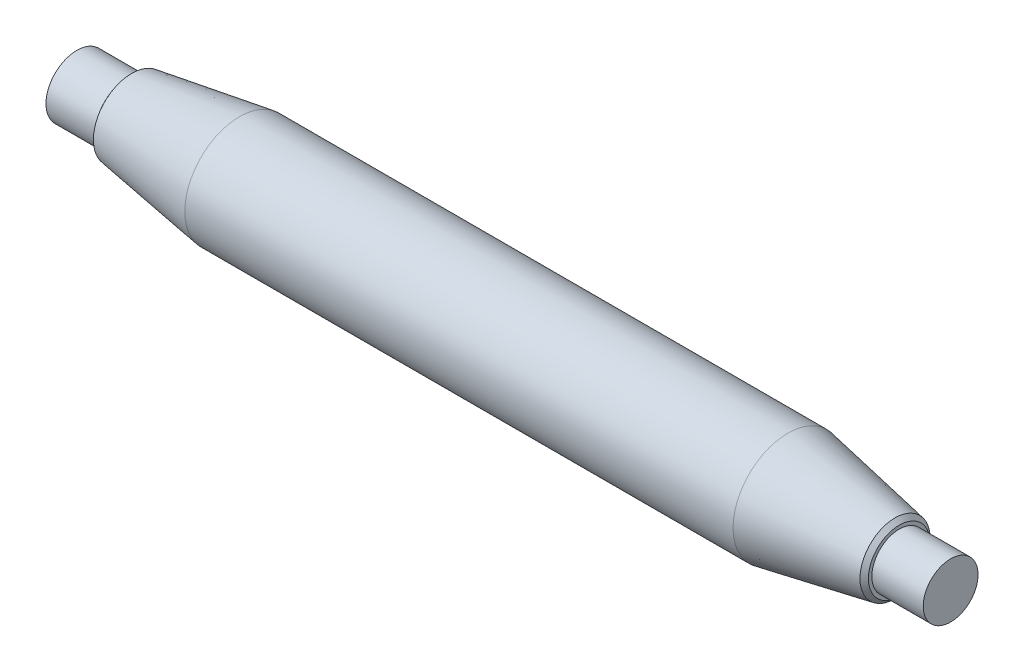
ISO-10303-21;
HEADER;
FILE_DESCRIPTION(('STEP AP214'),'2;1');
FILE_NAME('part.step','',(''),(''),'','','');
FILE_SCHEMA(('AUTOMOTIVE_DESIGN { 1 0 10303 214 1 1 1 1 }'));
ENDSEC;
DATA;
#1=APPLICATION_CONTEXT('core data for automotive mechanical design processes');
#2=APPLICATION_PROTOCOL_DEFINITION('international standard','automotive_design',2000,#1);
#3=PRODUCT_CONTEXT('',#1,'mechanical');
#4=PRODUCT('Part','Part','',(#3));
#5=PRODUCT_RELATED_PRODUCT_CATEGORY('part','',(#4));
#6=PRODUCT_DEFINITION_FORMATION('','',#4);
#7=PRODUCT_DEFINITION_CONTEXT('part definition',#1,'design');
#8=PRODUCT_DEFINITION('design','',#6,#7);
#9=PRODUCT_DEFINITION_SHAPE('','',#8);
#10=(LENGTH_UNIT() NAMED_UNIT(*) SI_UNIT(.MILLI.,.METRE.));
#11=(NAMED_UNIT(*) PLANE_ANGLE_UNIT() SI_UNIT($,.RADIAN.));
#12=(NAMED_UNIT(*) SI_UNIT($,.STERADIAN.) SOLID_ANGLE_UNIT());
#13=UNCERTAINTY_MEASURE_WITH_UNIT(LENGTH_MEASURE(1.E-05),#10,'distance_accuracy_value','');
#14=(GEOMETRIC_REPRESENTATION_CONTEXT(3) GLOBAL_UNCERTAINTY_ASSIGNED_CONTEXT((#13)) GLOBAL_UNIT_ASSIGNED_CONTEXT((#10,
#11,#12)) REPRESENTATION_CONTEXT('',''));
#15=CARTESIAN_POINT('',(0.,0.,0.));
#16=DIRECTION('',(0.,0.,1.));
#17=DIRECTION('',(1.,0.,0.));
#18=AXIS2_PLACEMENT_3D('',#15,#16,#17);
#19=CARTESIAN_POINT('',(127.5,0.,0.));
#20=DIRECTION('',(-1.,0.,0.));
#21=DIRECTION('',(0.,0.,1.));
#22=AXIS2_PLACEMENT_3D('',#19,#20,#21);
#23=PLANE('',#22);
#24=CARTESIAN_POINT('',(127.5,0.,0.));
#25=DIRECTION('',(-1.,0.,0.));
#26=DIRECTION('',(0.,0.,1.));
#27=AXIS2_PLACEMENT_3D('',#24,#25,#26);
#28=CIRCLE('',#27,7.99999999999999);
#29=CARTESIAN_POINT('',(127.5,0.,7.99999999999999));
#30=VERTEX_POINT('',#29);
#31=EDGE_CURVE('E74',#30,#30,#28,.T.);
#32=ORIENTED_EDGE('',*,*,#31,.F.);
#33=EDGE_LOOP('',(#32));
#34=FACE_BOUND('',#33,.T.);
#35=ADVANCED_FACE('F33',(#34),#23,.F.);
#36=CARTESIAN_POINT('',(-127.5,0.,0.));
#37=DIRECTION('',(-1.,0.,0.));
#38=DIRECTION('',(0.,0.,1.));
#39=AXIS2_PLACEMENT_3D('',#36,#37,#38);
#40=CYLINDRICAL_SURFACE('',#39,7.99999999999999);
#41=CARTESIAN_POINT('',(112.5,0.,0.));
#42=DIRECTION('',(-1.,0.,0.));
#43=DIRECTION('',(0.,0.,1.));
#44=AXIS2_PLACEMENT_3D('',#41,#42,#43);
#45=CIRCLE('',#44,7.99999999999999);
#46=CARTESIAN_POINT('',(112.5,0.,7.99999999999999));
#47=VERTEX_POINT('',#46);
#48=EDGE_CURVE('E71',#47,#47,#45,.T.);
#49=ORIENTED_EDGE('',*,*,#48,.F.);
#50=EDGE_LOOP('',(#49));
#51=FACE_BOUND('',#50,.T.);
#52=ORIENTED_EDGE('',*,*,#31,.T.);
#53=EDGE_LOOP('',(#52));
#54=FACE_BOUND('',#53,.T.);
#55=ADVANCED_FACE('F113',(#51,#54),#40,.T.);
#56=CARTESIAN_POINT('',(112.5,7.99999999999999,0.));
#57=DIRECTION('',(-1.,0.,0.));
#58=DIRECTION('',(0.,0.,1.));
#59=AXIS2_PLACEMENT_3D('',#56,#57,#58);
#60=PLANE('',#59);
#61=CARTESIAN_POINT('',(112.5,0.,0.));
#62=DIRECTION('',(-1.,0.,0.));
#63=DIRECTION('',(0.,0.,1.));
#64=AXIS2_PLACEMENT_3D('',#61,#62,#63);
#65=CIRCLE('',#64,8.99999999999998);
#66=CARTESIAN_POINT('',(112.5,0.,8.99999999999998));
#67=VERTEX_POINT('',#66);
#68=EDGE_CURVE('E55',#67,#67,#65,.F.);
#69=ORIENTED_EDGE('',*,*,#68,.T.);
#70=EDGE_LOOP('',(#69));
#71=FACE_BOUND('',#70,.T.);
#72=ORIENTED_EDGE('',*,*,#48,.T.);
#73=EDGE_LOOP('',(#72));
#74=FACE_BOUND('',#73,.T.);
#75=ADVANCED_FACE('F89',(#71,#74),#60,.F.);
#76=CARTESIAN_POINT('',(112.5,0.,0.));
#77=DIRECTION('',(-1.,0.,0.));
#78=DIRECTION('',(0.,0.,1.));
#79=AXIS2_PLACEMENT_3D('',#76,#77,#78);
#80=CONICAL_SURFACE('',#79,10.,0.182559853130907);
#81=CARTESIAN_POINT('',(111.27358490566,0.,0.));
#82=DIRECTION('',(1.,0.,0.));
#83=DIRECTION('',(0.,0.,-1.));
#84=AXIS2_PLACEMENT_3D('',#81,#82,#83);
#85=CIRCLE('',#84,10.2264150943396);
#86=CARTESIAN_POINT('',(111.27358490566,0.,-10.2264150943396));
#87=VERTEX_POINT('',#86);
#88=EDGE_CURVE('E83',#87,#87,#85,.F.);
#89=ORIENTED_EDGE('',*,*,#88,.T.);
#90=EDGE_LOOP('',(#89));
#91=FACE_BOUND('',#90,.T.);
#92=CARTESIAN_POINT('',(80.,0.,0.));
#93=DIRECTION('',(-1.,0.,0.));
#94=DIRECTION('',(0.,0.,1.));
#95=AXIS2_PLACEMENT_3D('',#92,#93,#94);
#96=CIRCLE('',#95,16.);
#97=CARTESIAN_POINT('',(80.,0.,16.));
#98=VERTEX_POINT('',#97);
#99=EDGE_CURVE('E68',#98,#98,#96,.T.);
#100=ORIENTED_EDGE('',*,*,#99,.F.);
#101=EDGE_LOOP('',(#100));
#102=FACE_BOUND('',#101,.T.);
#103=ADVANCED_FACE('F97',(#91,#102),#80,.T.);
#104=CARTESIAN_POINT('',(-127.5,0.,0.));
#105=DIRECTION('',(-1.,0.,0.));
#106=DIRECTION('',(0.,0.,1.));
#107=AXIS2_PLACEMENT_3D('',#104,#105,#106);
#108=CYLINDRICAL_SURFACE('',#107,16.);
#109=CARTESIAN_POINT('',(-22.7513466447618,0.,0.));
#110=DIRECTION('',(-0.990268068741571,0.,0.139173100960059));
#111=DIRECTION('',(-0.139173100960059,0.,-0.990268068741571));
#112=AXIS2_PLACEMENT_3D('',#109,#110,#111);
#113=ELLIPSE('',#112,16.1572411602979,16.);
#114=CARTESIAN_POINT('',(-24.3220796789207,11.4494228667417,-11.1763462732027));
#115=VERTEX_POINT('',#114);
#116=CARTESIAN_POINT('',(-24.3220796789207,-11.4494228667417,-11.1763462732027));
#117=VERTEX_POINT('',#116);
#118=EDGE_CURVE('E41',#115,#117,#113,.T.);
#119=ORIENTED_EDGE('',*,*,#118,.T.);
#120=CARTESIAN_POINT('',(-103.845915558153,0.,0.));
#121=DIRECTION('',(0.139173100960059,0.,0.990268068741571));
#122=DIRECTION('',(-0.990268068741571,0.,0.139173100960059));
#123=AXIS2_PLACEMENT_3D('',#120,#121,#122);
#124=ELLIPSE('',#123,114.964744549249,16.);
#125=EDGE_CURVE('E11',#117,#115,#124,.T.);
#126=ORIENTED_EDGE('',*,*,#125,.T.);
#127=EDGE_LOOP('',(#119,#126));
#128=FACE_BOUND('',#127,.T.);
#129=CARTESIAN_POINT('',(-80.,0.,0.));
#130=DIRECTION('',(-1.,0.,0.));
#131=DIRECTION('',(0.,0.,1.));
#132=AXIS2_PLACEMENT_3D('',#129,#130,#131);
#133=CIRCLE('',#132,16.);
#134=CARTESIAN_POINT('',(-80.,0.,16.));
#135=VERTEX_POINT('',#134);
#136=EDGE_CURVE('E65',#135,#135,#133,.T.);
#137=ORIENTED_EDGE('',*,*,#136,.F.);
#138=EDGE_LOOP('',(#137));
#139=FACE_BOUND('',#138,.T.);
#140=ORIENTED_EDGE('',*,*,#99,.T.);
#141=EDGE_LOOP('',(#140));
#142=FACE_BOUND('',#141,.T.);
#143=ADVANCED_FACE('F53',(#128,#139,#142),#108,.T.);
#144=CARTESIAN_POINT('',(-80.,0.,0.));
#145=DIRECTION('',(1.,0.,0.));
#146=DIRECTION('',(0.,0.,-1.));
#147=AXIS2_PLACEMENT_3D('',#144,#145,#146);
#148=CONICAL_SURFACE('',#147,16.,0.152649328395265);
#149=CARTESIAN_POINT('',(-111.511628302349,0.,0.));
#150=DIRECTION('',(-1.,0.,0.));
#151=DIRECTION('',(0.,0.,1.));
#152=AXIS2_PLACEMENT_3D('',#149,#150,#151);
#153=CIRCLE('',#152,11.1520571842539);
#154=CARTESIAN_POINT('',(-111.511628302349,0.,11.1520571842539));
#155=VERTEX_POINT('',#154);
#156=EDGE_CURVE('E80',#155,#155,#153,.F.);
#157=ORIENTED_EDGE('',*,*,#156,.T.);
#158=EDGE_LOOP('',(#157));
#159=FACE_BOUND('',#158,.T.);
#160=ORIENTED_EDGE('',*,*,#136,.T.);
#161=EDGE_LOOP('',(#160));
#162=FACE_BOUND('',#161,.T.);
#163=ADVANCED_FACE('F104',(#159,#162),#148,.T.);
#164=CARTESIAN_POINT('',(-112.5,9.,0.));
#165=DIRECTION('',(1.,0.,0.));
#166=DIRECTION('',(0.,0.,-1.));
#167=AXIS2_PLACEMENT_3D('',#164,#165,#166);
#168=PLANE('',#167);
#169=CARTESIAN_POINT('',(-112.5,0.,0.));
#170=DIRECTION('',(1.,0.,0.));
#171=DIRECTION('',(0.,0.,-1.));
#172=AXIS2_PLACEMENT_3D('',#169,#170,#171);
#173=CIRCLE('',#172,9.8042775965485);
#174=CARTESIAN_POINT('',(-112.5,0.,-9.8042775965485));
#175=VERTEX_POINT('',#174);
#176=EDGE_CURVE('E77',#175,#175,#173,.F.);
#177=ORIENTED_EDGE('',*,*,#176,.T.);
#178=EDGE_LOOP('',(#177));
#179=FACE_BOUND('',#178,.T.);
#180=CARTESIAN_POINT('',(-112.5,0.,0.));
#181=DIRECTION('',(-1.,0.,0.));
#182=DIRECTION('',(0.,0.,1.));
#183=AXIS2_PLACEMENT_3D('',#180,#181,#182);
#184=CIRCLE('',#183,9.);
#185=CARTESIAN_POINT('',(-112.5,0.,9.));
#186=VERTEX_POINT('',#185);
#187=EDGE_CURVE('E60',#186,#186,#184,.T.);
#188=ORIENTED_EDGE('',*,*,#187,.F.);
#189=EDGE_LOOP('',(#188));
#190=FACE_BOUND('',#189,.T.);
#191=ADVANCED_FACE('F109',(#179,#190),#168,.F.);
#192=CARTESIAN_POINT('',(-127.5,0.,0.));
#193=DIRECTION('',(-1.,0.,0.));
#194=DIRECTION('',(0.,0.,1.));
#195=AXIS2_PLACEMENT_3D('',#192,#193,#194);
#196=CYLINDRICAL_SURFACE('',#195,9.);
#197=CARTESIAN_POINT('',(-127.5,0.,0.));
#198=DIRECTION('',(-1.,0.,0.));
#199=DIRECTION('',(0.,0.,1.));
#200=AXIS2_PLACEMENT_3D('',#197,#198,#199);
#201=CIRCLE('',#200,9.);
#202=CARTESIAN_POINT('',(-127.5,0.,9.));
#203=VERTEX_POINT('',#202);
#204=EDGE_CURVE('E57',#203,#203,#201,.T.);
#205=ORIENTED_EDGE('',*,*,#204,.F.);
#206=EDGE_LOOP('',(#205));
#207=FACE_BOUND('',#206,.T.);
#208=ORIENTED_EDGE('',*,*,#187,.T.);
#209=EDGE_LOOP('',(#208));
#210=FACE_BOUND('',#209,.T.);
#211=ADVANCED_FACE('F129',(#207,#210),#196,.T.);
#212=CARTESIAN_POINT('',(-127.5,0.,0.));
#213=DIRECTION('',(1.,0.,0.));
#214=DIRECTION('',(0.,0.,-1.));
#215=AXIS2_PLACEMENT_3D('',#212,#213,#214);
#216=PLANE('',#215);
#217=ORIENTED_EDGE('',*,*,#204,.T.);
#218=EDGE_LOOP('',(#217));
#219=FACE_BOUND('',#218,.T.);
#220=ADVANCED_FACE('F124',(#219),#216,.F.);
#221=CARTESIAN_POINT('',(-112.5,0.,0.));
#222=DIRECTION('',(1.,0.,0.));
#223=DIRECTION('',(0.,0.,-1.));
#224=AXIS2_PLACEMENT_3D('',#221,#222,#223);
#225=CONICAL_SURFACE('',#224,9.8042775965485,0.938047491792712);
#226=ORIENTED_EDGE('',*,*,#156,.F.);
#227=EDGE_LOOP('',(#226));
#228=FACE_BOUND('',#227,.T.);
#229=ORIENTED_EDGE('',*,*,#176,.F.);
#230=EDGE_LOOP('',(#229));
#231=FACE_BOUND('',#230,.T.);
#232=ADVANCED_FACE('F94',(#228,#231),#225,.T.);
#233=CARTESIAN_POINT('',(111.27358490566,0.,0.));
#234=DIRECTION('',(-1.,0.,0.));
#235=DIRECTION('',(0.,0.,1.));
#236=AXIS2_PLACEMENT_3D('',#233,#234,#235);
#237=CONICAL_SURFACE('',#236,10.2264150943396,0.785398163397448);
#238=ORIENTED_EDGE('',*,*,#68,.F.);
#239=EDGE_LOOP('',(#238));
#240=FACE_BOUND('',#239,.T.);
#241=ORIENTED_EDGE('',*,*,#88,.F.);
#242=EDGE_LOOP('',(#241));
#243=FACE_BOUND('',#242,.T.);
#244=ADVANCED_FACE('F35',(#240,#243),#237,.T.);
#245=CARTESIAN_POINT('',(-24.3220796789207,-16.,-11.1763462732027));
#246=DIRECTION('',(0.139173100960059,0.,0.990268068741571));
#247=DIRECTION('',(0.990268068741571,0.,-0.139173100960059));
#248=AXIS2_PLACEMENT_3D('',#245,#246,#247);
#249=PLANE('',#248);
#250=DIRECTION('',(0.,1.,0.));
#251=VECTOR('',#250,1.);
#252=CARTESIAN_POINT('',(-24.3220796789207,-16.,-11.1763462732027));
#253=LINE('',#252,#251);
#254=EDGE_CURVE('E51',#117,#115,#253,.T.);
#255=ORIENTED_EDGE('',*,*,#254,.T.);
#256=ORIENTED_EDGE('',*,*,#125,.F.);
#257=EDGE_LOOP('',(#255,#256));
#258=FACE_BOUND('',#257,.T.);
#259=ADVANCED_FACE('F50',(#258),#249,.F.);
#260=CARTESIAN_POINT('',(-25.,-16.,-16.));
#261=DIRECTION('',(-0.990268068741571,0.,0.139173100960059));
#262=DIRECTION('',(0.139173100960059,0.,0.990268068741571));
#263=AXIS2_PLACEMENT_3D('',#260,#261,#262);
#264=PLANE('',#263);
#265=ORIENTED_EDGE('',*,*,#118,.F.);
#266=ORIENTED_EDGE('',*,*,#254,.F.);
#267=EDGE_LOOP('',(#265,#266));
#268=FACE_BOUND('',#267,.T.);
#269=ADVANCED_FACE('F56',(#268),#264,.F.);
#270=CLOSED_SHELL('',(#35,#55,#75,#103,#143,#163,#191,#211,#220,#232,#244,#259,#269));
#271=MANIFOLD_SOLID_BREP('B2',#270);
#272=ADVANCED_BREP_SHAPE_REPRESENTATION('',(#18,#271),#14);
#273=SHAPE_DEFINITION_REPRESENTATION(#9,#272);
ENDSEC;
END-ISO-10303-21;
